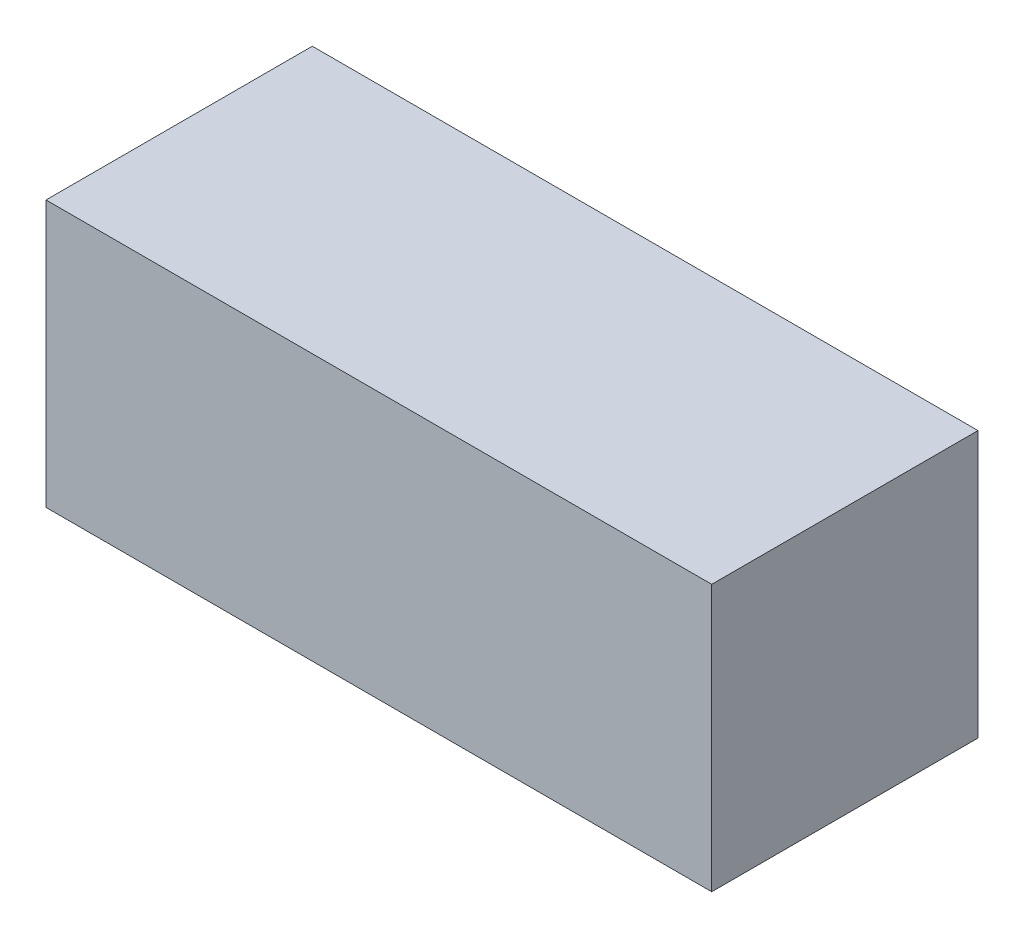
ISO-10303-21;
HEADER;
FILE_DESCRIPTION(('STEP AP214'),'2;1');
FILE_NAME('part.step','',(''),(''),'','','');
FILE_SCHEMA(('AUTOMOTIVE_DESIGN { 1 0 10303 214 1 1 1 1 }'));
ENDSEC;
DATA;
#1=APPLICATION_CONTEXT('core data for automotive mechanical design processes');
#2=APPLICATION_PROTOCOL_DEFINITION('international standard','automotive_design',2000,#1);
#3=PRODUCT_CONTEXT('',#1,'mechanical');
#4=PRODUCT('Part','Part','',(#3));
#5=PRODUCT_RELATED_PRODUCT_CATEGORY('part','',(#4));
#6=PRODUCT_DEFINITION_FORMATION('','',#4);
#7=PRODUCT_DEFINITION_CONTEXT('part definition',#1,'design');
#8=PRODUCT_DEFINITION('design','',#6,#7);
#9=PRODUCT_DEFINITION_SHAPE('','',#8);
#10=(LENGTH_UNIT() NAMED_UNIT(*) SI_UNIT(.MILLI.,.METRE.));
#11=(NAMED_UNIT(*) PLANE_ANGLE_UNIT() SI_UNIT($,.RADIAN.));
#12=(NAMED_UNIT(*) SI_UNIT($,.STERADIAN.) SOLID_ANGLE_UNIT());
#13=UNCERTAINTY_MEASURE_WITH_UNIT(LENGTH_MEASURE(1.E-05),#10,'distance_accuracy_value','');
#14=(GEOMETRIC_REPRESENTATION_CONTEXT(3) GLOBAL_UNCERTAINTY_ASSIGNED_CONTEXT((#13)) GLOBAL_UNIT_ASSIGNED_CONTEXT((#10,
#11,#12)) REPRESENTATION_CONTEXT('',''));
#15=CARTESIAN_POINT('',(0.,0.,0.));
#16=DIRECTION('',(0.,0.,1.));
#17=DIRECTION('',(1.,0.,0.));
#18=AXIS2_PLACEMENT_3D('',#15,#16,#17);
#19=CARTESIAN_POINT('',(0.,25.4,0.));
#20=DIRECTION('',(1.,0.,0.));
#21=DIRECTION('',(0.,0.,-1.));
#22=AXIS2_PLACEMENT_3D('',#19,#20,#21);
#23=PLANE('',#22);
#24=DIRECTION('',(0.,0.,1.));
#25=VECTOR('',#24,1.);
#26=CARTESIAN_POINT('',(0.,0.,0.));
#27=LINE('',#26,#25);
#28=CARTESIAN_POINT('',(0.,0.,-25.4));
#29=VERTEX_POINT('',#28);
#30=CARTESIAN_POINT('',(0.,0.,0.));
#31=VERTEX_POINT('',#30);
#32=EDGE_CURVE('E97',#29,#31,#27,.T.);
#33=ORIENTED_EDGE('',*,*,#32,.T.);
#34=DIRECTION('',(0.,-1.,0.));
#35=VECTOR('',#34,1.);
#36=CARTESIAN_POINT('',(0.,25.4,0.));
#37=LINE('',#36,#35);
#38=CARTESIAN_POINT('',(0.,25.4,0.));
#39=VERTEX_POINT('',#38);
#40=EDGE_CURVE('E11',#39,#31,#37,.T.);
#41=ORIENTED_EDGE('',*,*,#40,.F.);
#42=DIRECTION('',(0.,0.,1.));
#43=VECTOR('',#42,1.);
#44=CARTESIAN_POINT('',(0.,25.4,0.));
#45=LINE('',#44,#43);
#46=CARTESIAN_POINT('',(0.,25.4,-25.4));
#47=VERTEX_POINT('',#46);
#48=EDGE_CURVE('E85',#47,#39,#45,.T.);
#49=ORIENTED_EDGE('',*,*,#48,.F.);
#50=DIRECTION('',(0.,-1.,0.));
#51=VECTOR('',#50,1.);
#52=CARTESIAN_POINT('',(0.,25.4,-25.4));
#53=LINE('',#52,#51);
#54=EDGE_CURVE('E93',#47,#29,#53,.T.);
#55=ORIENTED_EDGE('',*,*,#54,.T.);
#56=EDGE_LOOP('',(#33,#41,#49,#55));
#57=FACE_BOUND('',#56,.T.);
#58=ADVANCED_FACE('F34',(#57),#23,.F.);
#59=CARTESIAN_POINT('',(0.,25.4,0.));
#60=DIRECTION('',(0.,0.,-1.));
#61=DIRECTION('',(-1.,0.,0.));
#62=AXIS2_PLACEMENT_3D('',#59,#60,#61);
#63=PLANE('',#62);
#64=DIRECTION('',(1.,0.,0.));
#65=VECTOR('',#64,1.);
#66=CARTESIAN_POINT('',(0.,0.,0.));
#67=LINE('',#66,#65);
#68=CARTESIAN_POINT('',(63.5,0.,0.));
#69=VERTEX_POINT('',#68);
#70=EDGE_CURVE('E89',#31,#69,#67,.T.);
#71=ORIENTED_EDGE('',*,*,#70,.T.);
#72=DIRECTION('',(0.,-1.,0.));
#73=VECTOR('',#72,1.);
#74=CARTESIAN_POINT('',(63.5,25.4,0.));
#75=LINE('',#74,#73);
#76=CARTESIAN_POINT('',(63.5,25.4,0.));
#77=VERTEX_POINT('',#76);
#78=EDGE_CURVE('E42',#77,#69,#75,.T.);
#79=ORIENTED_EDGE('',*,*,#78,.F.);
#80=DIRECTION('',(1.,0.,0.));
#81=VECTOR('',#80,1.);
#82=CARTESIAN_POINT('',(0.,25.4,0.));
#83=LINE('',#82,#81);
#84=EDGE_CURVE('E80',#39,#77,#83,.T.);
#85=ORIENTED_EDGE('',*,*,#84,.F.);
#86=ORIENTED_EDGE('',*,*,#40,.T.);
#87=EDGE_LOOP('',(#71,#79,#85,#86));
#88=FACE_BOUND('',#87,.T.);
#89=ADVANCED_FACE('F88',(#88),#63,.F.);
#90=CARTESIAN_POINT('',(63.5,25.4,0.));
#91=DIRECTION('',(-1.,0.,0.));
#92=DIRECTION('',(0.,0.,1.));
#93=AXIS2_PLACEMENT_3D('',#90,#91,#92);
#94=PLANE('',#93);
#95=DIRECTION('',(0.,0.,-1.));
#96=VECTOR('',#95,1.);
#97=CARTESIAN_POINT('',(63.5,0.,0.));
#98=LINE('',#97,#96);
#99=CARTESIAN_POINT('',(63.5,0.,-25.4));
#100=VERTEX_POINT('',#99);
#101=EDGE_CURVE('E67',#69,#100,#98,.T.);
#102=ORIENTED_EDGE('',*,*,#101,.T.);
#103=DIRECTION('',(0.,-1.,0.));
#104=VECTOR('',#103,1.);
#105=CARTESIAN_POINT('',(63.5,25.4,-25.4));
#106=LINE('',#105,#104);
#107=CARTESIAN_POINT('',(63.5,25.4,-25.4));
#108=VERTEX_POINT('',#107);
#109=EDGE_CURVE('E90',#108,#100,#106,.T.);
#110=ORIENTED_EDGE('',*,*,#109,.F.);
#111=DIRECTION('',(0.,0.,-1.));
#112=VECTOR('',#111,1.);
#113=CARTESIAN_POINT('',(63.5,25.4,0.));
#114=LINE('',#113,#112);
#115=EDGE_CURVE('E83',#77,#108,#114,.T.);
#116=ORIENTED_EDGE('',*,*,#115,.F.);
#117=ORIENTED_EDGE('',*,*,#78,.T.);
#118=EDGE_LOOP('',(#102,#110,#116,#117));
#119=FACE_BOUND('',#118,.T.);
#120=ADVANCED_FACE('F91',(#119),#94,.F.);
#121=CARTESIAN_POINT('',(0.,25.4,-25.4));
#122=DIRECTION('',(0.,0.,1.));
#123=DIRECTION('',(1.,0.,0.));
#124=AXIS2_PLACEMENT_3D('',#121,#122,#123);
#125=PLANE('',#124);
#126=DIRECTION('',(-1.,0.,0.));
#127=VECTOR('',#126,1.);
#128=CARTESIAN_POINT('',(0.,0.,-25.4));
#129=LINE('',#128,#127);
#130=EDGE_CURVE('E73',#100,#29,#129,.T.);
#131=ORIENTED_EDGE('',*,*,#130,.T.);
#132=ORIENTED_EDGE('',*,*,#54,.F.);
#133=DIRECTION('',(-1.,0.,0.));
#134=VECTOR('',#133,1.);
#135=CARTESIAN_POINT('',(0.,25.4,-25.4));
#136=LINE('',#135,#134);
#137=EDGE_CURVE('E50',#108,#47,#136,.T.);
#138=ORIENTED_EDGE('',*,*,#137,.F.);
#139=ORIENTED_EDGE('',*,*,#109,.T.);
#140=EDGE_LOOP('',(#131,#132,#138,#139));
#141=FACE_BOUND('',#140,.T.);
#142=ADVANCED_FACE('F104',(#141),#125,.F.);
#143=CARTESIAN_POINT('',(0.,25.4,-25.4));
#144=DIRECTION('',(0.,-1.,0.));
#145=DIRECTION('',(0.,0.,-1.));
#146=AXIS2_PLACEMENT_3D('',#143,#144,#145);
#147=PLANE('',#146);
#148=ORIENTED_EDGE('',*,*,#48,.T.);
#149=ORIENTED_EDGE('',*,*,#84,.T.);
#150=ORIENTED_EDGE('',*,*,#115,.T.);
#151=ORIENTED_EDGE('',*,*,#137,.T.);
#152=EDGE_LOOP('',(#148,#149,#150,#151));
#153=FACE_BOUND('',#152,.T.);
#154=ADVANCED_FACE('F81',(#153),#147,.F.);
#155=CARTESIAN_POINT('',(0.,0.,-25.4));
#156=DIRECTION('',(0.,-1.,0.));
#157=DIRECTION('',(0.,0.,-1.));
#158=AXIS2_PLACEMENT_3D('',#155,#156,#157);
#159=PLANE('',#158);
#160=ORIENTED_EDGE('',*,*,#32,.F.);
#161=ORIENTED_EDGE('',*,*,#130,.F.);
#162=ORIENTED_EDGE('',*,*,#101,.F.);
#163=ORIENTED_EDGE('',*,*,#70,.F.);
#164=EDGE_LOOP('',(#160,#161,#162,#163));
#165=FACE_BOUND('',#164,.T.);
#166=ADVANCED_FACE('F107',(#165),#159,.T.);
#167=CLOSED_SHELL('',(#58,#89,#120,#142,#154,#166));
#168=MANIFOLD_SOLID_BREP('B2',#167);
#169=ADVANCED_BREP_SHAPE_REPRESENTATION('',(#18,#168),#14);
#170=SHAPE_DEFINITION_REPRESENTATION(#9,#169);
ENDSEC;
END-ISO-10303-21;
